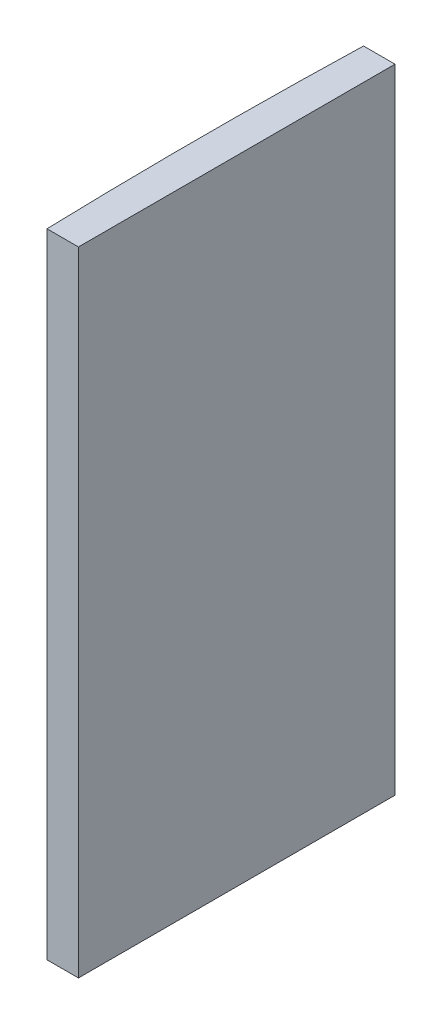
ISO-10303-21;
HEADER;
FILE_DESCRIPTION(('STEP AP214'),'2;1');
FILE_NAME('part.step','',(''),(''),'','','');
FILE_SCHEMA(('AUTOMOTIVE_DESIGN { 1 0 10303 214 1 1 1 1 }'));
ENDSEC;
DATA;
#1=APPLICATION_CONTEXT('core data for automotive mechanical design processes');
#2=APPLICATION_PROTOCOL_DEFINITION('international standard','automotive_design',2000,#1);
#3=PRODUCT_CONTEXT('',#1,'mechanical');
#4=PRODUCT('Part','Part','',(#3));
#5=PRODUCT_RELATED_PRODUCT_CATEGORY('part','',(#4));
#6=PRODUCT_DEFINITION_FORMATION('','',#4);
#7=PRODUCT_DEFINITION_CONTEXT('part definition',#1,'design');
#8=PRODUCT_DEFINITION('design','',#6,#7);
#9=PRODUCT_DEFINITION_SHAPE('','',#8);
#10=(LENGTH_UNIT() NAMED_UNIT(*) SI_UNIT(.MILLI.,.METRE.));
#11=(NAMED_UNIT(*) PLANE_ANGLE_UNIT() SI_UNIT($,.RADIAN.));
#12=(NAMED_UNIT(*) SI_UNIT($,.STERADIAN.) SOLID_ANGLE_UNIT());
#13=UNCERTAINTY_MEASURE_WITH_UNIT(LENGTH_MEASURE(1.E-05),#10,'distance_accuracy_value','');
#14=(GEOMETRIC_REPRESENTATION_CONTEXT(3) GLOBAL_UNCERTAINTY_ASSIGNED_CONTEXT((#13)) GLOBAL_UNIT_ASSIGNED_CONTEXT((#10,
#11,#12)) REPRESENTATION_CONTEXT('',''));
#15=CARTESIAN_POINT('',(0.,0.,0.));
#16=DIRECTION('',(0.,0.,1.));
#17=DIRECTION('',(1.,0.,0.));
#18=AXIS2_PLACEMENT_3D('',#15,#16,#17);
#19=CARTESIAN_POINT('',(4.35520433485127,60.,0.));
#20=DIRECTION('',(0.,-1.,0.));
#21=DIRECTION('',(0.,0.,-1.));
#22=AXIS2_PLACEMENT_3D('',#19,#20,#21);
#23=CYLINDRICAL_SURFACE('',#22,516.8);
#24=CARTESIAN_POINT('',(4.35520433485127,0.,0.));
#25=DIRECTION('',(0.,1.,0.));
#26=DIRECTION('',(0.,0.,1.));
#27=AXIS2_PLACEMENT_3D('',#24,#25,#26);
#28=CIRCLE('',#27,516.8);
#29=CARTESIAN_POINT('',(-512.227064040671,0.,-15.));
#30=VERTEX_POINT('',#29);
#31=CARTESIAN_POINT('',(-512.227064040671,0.,15.));
#32=VERTEX_POINT('',#31);
#33=EDGE_CURVE('E100',#30,#32,#28,.T.);
#34=ORIENTED_EDGE('',*,*,#33,.T.);
#35=DIRECTION('',(0.,-1.,0.));
#36=VECTOR('',#35,1.);
#37=CARTESIAN_POINT('',(-512.227064040671,60.,15.));
#38=LINE('',#37,#36);
#39=CARTESIAN_POINT('',(-512.227064040671,60.,15.));
#40=VERTEX_POINT('',#39);
#41=EDGE_CURVE('E11',#40,#32,#38,.T.);
#42=ORIENTED_EDGE('',*,*,#41,.F.);
#43=CARTESIAN_POINT('',(4.35520433485127,60.,0.));
#44=DIRECTION('',(0.,1.,0.));
#45=DIRECTION('',(0.,0.,1.));
#46=AXIS2_PLACEMENT_3D('',#43,#44,#45);
#47=CIRCLE('',#46,516.8);
#48=CARTESIAN_POINT('',(-512.227064040671,60.,-15.));
#49=VERTEX_POINT('',#48);
#50=EDGE_CURVE('E88',#49,#40,#47,.T.);
#51=ORIENTED_EDGE('',*,*,#50,.F.);
#52=DIRECTION('',(0.,-1.,0.));
#53=VECTOR('',#52,1.);
#54=CARTESIAN_POINT('',(-512.227064040671,60.,-15.));
#55=LINE('',#54,#53);
#56=EDGE_CURVE('E96',#49,#30,#55,.T.);
#57=ORIENTED_EDGE('',*,*,#56,.T.);
#58=EDGE_LOOP('',(#34,#42,#51,#57));
#59=FACE_BOUND('',#58,.T.);
#60=ADVANCED_FACE('F37',(#59),#23,.T.);
#61=CARTESIAN_POINT('',(-512.227064040671,60.,15.));
#62=DIRECTION('',(0.,0.,-1.));
#63=DIRECTION('',(-1.,0.,0.));
#64=AXIS2_PLACEMENT_3D('',#61,#62,#63);
#65=PLANE('',#64);
#66=DIRECTION('',(1.,0.,0.));
#67=VECTOR('',#66,1.);
#68=CARTESIAN_POINT('',(-512.227064040671,0.,15.));
#69=LINE('',#68,#67);
#70=CARTESIAN_POINT('',(-509.244795665149,0.,15.));
#71=VERTEX_POINT('',#70);
#72=EDGE_CURVE('E92',#32,#71,#69,.T.);
#73=ORIENTED_EDGE('',*,*,#72,.T.);
#74=DIRECTION('',(0.,-1.,0.));
#75=VECTOR('',#74,1.);
#76=CARTESIAN_POINT('',(-509.244795665149,60.,15.));
#77=LINE('',#76,#75);
#78=CARTESIAN_POINT('',(-509.244795665149,60.,15.));
#79=VERTEX_POINT('',#78);
#80=EDGE_CURVE('E45',#79,#71,#77,.T.);
#81=ORIENTED_EDGE('',*,*,#80,.F.);
#82=DIRECTION('',(1.,0.,0.));
#83=VECTOR('',#82,1.);
#84=CARTESIAN_POINT('',(-512.227064040671,60.,15.));
#85=LINE('',#84,#83);
#86=EDGE_CURVE('E83',#40,#79,#85,.T.);
#87=ORIENTED_EDGE('',*,*,#86,.F.);
#88=ORIENTED_EDGE('',*,*,#41,.T.);
#89=EDGE_LOOP('',(#73,#81,#87,#88));
#90=FACE_BOUND('',#89,.T.);
#91=ADVANCED_FACE('F91',(#90),#65,.F.);
#92=CARTESIAN_POINT('',(-509.244795665149,60.,-14.9999999999998));
#93=DIRECTION('',(-1.,0.,0.));
#94=DIRECTION('',(0.,0.,1.));
#95=AXIS2_PLACEMENT_3D('',#92,#93,#94);
#96=PLANE('',#95);
#97=DIRECTION('',(0.,0.,-1.));
#98=VECTOR('',#97,1.);
#99=CARTESIAN_POINT('',(-509.244795665149,0.,-14.9999999999998));
#100=LINE('',#99,#98);
#101=CARTESIAN_POINT('',(-509.244795665149,0.,-14.9999999999998));
#102=VERTEX_POINT('',#101);
#103=EDGE_CURVE('E70',#71,#102,#100,.T.);
#104=ORIENTED_EDGE('',*,*,#103,.T.);
#105=DIRECTION('',(0.,-1.,0.));
#106=VECTOR('',#105,1.);
#107=CARTESIAN_POINT('',(-509.244795665149,60.,-14.9999999999998));
#108=LINE('',#107,#106);
#109=CARTESIAN_POINT('',(-509.244795665149,60.,-14.9999999999998));
#110=VERTEX_POINT('',#109);
#111=EDGE_CURVE('E93',#110,#102,#108,.T.);
#112=ORIENTED_EDGE('',*,*,#111,.F.);
#113=DIRECTION('',(0.,0.,-1.));
#114=VECTOR('',#113,1.);
#115=CARTESIAN_POINT('',(-509.244795665149,60.,-14.9999999999998));
#116=LINE('',#115,#114);
#117=EDGE_CURVE('E86',#79,#110,#116,.T.);
#118=ORIENTED_EDGE('',*,*,#117,.F.);
#119=ORIENTED_EDGE('',*,*,#80,.T.);
#120=EDGE_LOOP('',(#104,#112,#118,#119));
#121=FACE_BOUND('',#120,.T.);
#122=ADVANCED_FACE('F94',(#121),#96,.F.);
#123=CARTESIAN_POINT('',(-512.227064040671,60.,-15.));
#124=DIRECTION('',(0.,0.,1.));
#125=DIRECTION('',(1.,0.,0.));
#126=AXIS2_PLACEMENT_3D('',#123,#124,#125);
#127=PLANE('',#126);
#128=DIRECTION('',(-1.,0.,0.));
#129=VECTOR('',#128,1.);
#130=CARTESIAN_POINT('',(-512.227064040671,0.,-15.));
#131=LINE('',#130,#129);
#132=EDGE_CURVE('E76',#102,#30,#131,.T.);
#133=ORIENTED_EDGE('',*,*,#132,.T.);
#134=ORIENTED_EDGE('',*,*,#56,.F.);
#135=DIRECTION('',(-1.,0.,0.));
#136=VECTOR('',#135,1.);
#137=CARTESIAN_POINT('',(-512.227064040671,60.,-15.));
#138=LINE('',#137,#136);
#139=EDGE_CURVE('E53',#110,#49,#138,.T.);
#140=ORIENTED_EDGE('',*,*,#139,.F.);
#141=ORIENTED_EDGE('',*,*,#111,.T.);
#142=EDGE_LOOP('',(#133,#134,#140,#141));
#143=FACE_BOUND('',#142,.T.);
#144=ADVANCED_FACE('F107',(#143),#127,.F.);
#145=CARTESIAN_POINT('',(4.35520433485127,60.,0.));
#146=DIRECTION('',(0.,1.,0.));
#147=DIRECTION('',(0.,0.,1.));
#148=AXIS2_PLACEMENT_3D('',#145,#146,#147);
#149=PLANE('',#148);
#150=ORIENTED_EDGE('',*,*,#50,.T.);
#151=ORIENTED_EDGE('',*,*,#86,.T.);
#152=ORIENTED_EDGE('',*,*,#117,.T.);
#153=ORIENTED_EDGE('',*,*,#139,.T.);
#154=EDGE_LOOP('',(#150,#151,#152,#153));
#155=FACE_BOUND('',#154,.T.);
#156=ADVANCED_FACE('F84',(#155),#149,.T.);
#157=CARTESIAN_POINT('',(4.35520433485127,0.,0.));
#158=DIRECTION('',(0.,1.,0.));
#159=DIRECTION('',(0.,0.,1.));
#160=AXIS2_PLACEMENT_3D('',#157,#158,#159);
#161=PLANE('',#160);
#162=ORIENTED_EDGE('',*,*,#33,.F.);
#163=ORIENTED_EDGE('',*,*,#132,.F.);
#164=ORIENTED_EDGE('',*,*,#103,.F.);
#165=ORIENTED_EDGE('',*,*,#72,.F.);
#166=EDGE_LOOP('',(#162,#163,#164,#165));
#167=FACE_BOUND('',#166,.T.);
#168=ADVANCED_FACE('F110',(#167),#161,.F.);
#169=CLOSED_SHELL('',(#60,#91,#122,#144,#156,#168));
#170=MANIFOLD_SOLID_BREP('B2',#169);
#171=ADVANCED_BREP_SHAPE_REPRESENTATION('',(#18,#170),#14);
#172=SHAPE_DEFINITION_REPRESENTATION(#9,#171);
ENDSEC;
END-ISO-10303-21;
